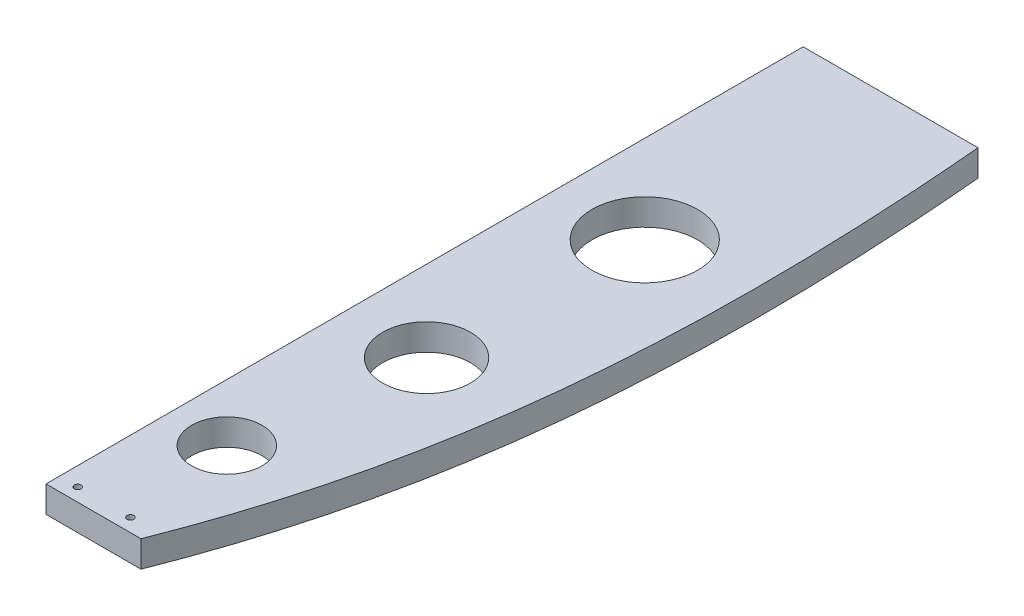
ISO-10303-21;
HEADER;
FILE_DESCRIPTION(('STEP AP214'),'2;1');
FILE_NAME('part.step','',(''),(''),'','','');
FILE_SCHEMA(('AUTOMOTIVE_DESIGN { 1 0 10303 214 1 1 1 1 }'));
ENDSEC;
DATA;
#1=APPLICATION_CONTEXT('core data for automotive mechanical design processes');
#2=APPLICATION_PROTOCOL_DEFINITION('international standard','automotive_design',2000,#1);
#3=PRODUCT_CONTEXT('',#1,'mechanical');
#4=PRODUCT('Part','Part','',(#3));
#5=PRODUCT_RELATED_PRODUCT_CATEGORY('part','',(#4));
#6=PRODUCT_DEFINITION_FORMATION('','',#4);
#7=PRODUCT_DEFINITION_CONTEXT('part definition',#1,'design');
#8=PRODUCT_DEFINITION('design','',#6,#7);
#9=PRODUCT_DEFINITION_SHAPE('','',#8);
#10=(LENGTH_UNIT() NAMED_UNIT(*) SI_UNIT(.MILLI.,.METRE.));
#11=(NAMED_UNIT(*) PLANE_ANGLE_UNIT() SI_UNIT($,.RADIAN.));
#12=(NAMED_UNIT(*) SI_UNIT($,.STERADIAN.) SOLID_ANGLE_UNIT());
#13=UNCERTAINTY_MEASURE_WITH_UNIT(LENGTH_MEASURE(1.E-05),#10,'distance_accuracy_value','');
#14=(GEOMETRIC_REPRESENTATION_CONTEXT(3) GLOBAL_UNCERTAINTY_ASSIGNED_CONTEXT((#13)) GLOBAL_UNIT_ASSIGNED_CONTEXT((#10,
#11,#12)) REPRESENTATION_CONTEXT('',''));
#15=CARTESIAN_POINT('',(0.,0.,0.));
#16=DIRECTION('',(0.,0.,1.));
#17=DIRECTION('',(1.,0.,0.));
#18=AXIS2_PLACEMENT_3D('',#15,#16,#17);
#19=CARTESIAN_POINT('',(392.720476188399,5372.1,2956.72721358891));
#20=DIRECTION('',(0.,1.,0.));
#21=DIRECTION('',(0.,0.,1.));
#22=AXIS2_PLACEMENT_3D('',#19,#20,#21);
#23=PLANE('',#22);
#24=CARTESIAN_POINT('',(376.528681754762,5372.1,3220.41942707641));
#25=DIRECTION('',(0.,1.,0.));
#26=DIRECTION('',(0.,0.,1.));
#27=AXIS2_PLACEMENT_3D('',#24,#25,#26);
#28=CIRCLE('',#27,2.45744999999997);
#29=CARTESIAN_POINT('',(376.528681754762,5372.1,3222.87687707641));
#30=VERTEX_POINT('',#29);
#31=EDGE_CURVE('E461',#30,#30,#28,.T.);
#32=ORIENTED_EDGE('',*,*,#31,.T.);
#33=EDGE_LOOP('',(#32));
#34=FACE_BOUND('',#33,.T.);
#35=CARTESIAN_POINT('',(338.428578956923,5372.1,3220.4194270765));
#36=DIRECTION('',(0.,1.,0.));
#37=DIRECTION('',(0.,0.,1.));
#38=AXIS2_PLACEMENT_3D('',#35,#36,#37);
#39=CIRCLE('',#38,2.45744999999997);
#40=CARTESIAN_POINT('',(338.428578956923,5372.1,3222.8768770765));
#41=VERTEX_POINT('',#40);
#42=EDGE_CURVE('E114',#41,#41,#39,.T.);
#43=ORIENTED_EDGE('',*,*,#42,.T.);
#44=EDGE_LOOP('',(#43));
#45=FACE_BOUND('',#44,.T.);
#46=CARTESIAN_POINT('',(388.619999999992,5372.1,2861.31));
#47=DIRECTION('',(0.,1.,0.));
#48=DIRECTION('',(-1.,0.,0.));
#49=AXIS2_PLACEMENT_3D('',#46,#47,#48);
#50=CIRCLE('',#49,38.0999999999997);
#51=CARTESIAN_POINT('',(350.519999999992,5372.1,2861.31));
#52=VERTEX_POINT('',#51);
#53=EDGE_CURVE('E156',#52,#52,#50,.T.);
#54=ORIENTED_EDGE('',*,*,#53,.T.);
#55=EDGE_LOOP('',(#54));
#56=FACE_BOUND('',#55,.T.);
#57=CARTESIAN_POINT('',(383.539999999992,5372.1,3013.71));
#58=DIRECTION('',(0.,1.,0.));
#59=DIRECTION('',(-1.,0.,0.));
#60=AXIS2_PLACEMENT_3D('',#57,#58,#59);
#61=CIRCLE('',#60,31.75);
#62=CARTESIAN_POINT('',(351.789999999992,5372.1,3013.71));
#63=VERTEX_POINT('',#62);
#64=EDGE_CURVE('E486',#63,#63,#61,.T.);
#65=ORIENTED_EDGE('',*,*,#64,.T.);
#66=EDGE_LOOP('',(#65));
#67=FACE_BOUND('',#66,.T.);
#68=CARTESIAN_POINT('',(366.394999999992,5372.1,3140.71));
#69=DIRECTION('',(0.,1.,0.));
#70=DIRECTION('',(-1.,0.,0.));
#71=AXIS2_PLACEMENT_3D('',#68,#69,#70);
#72=CIRCLE('',#71,25.4);
#73=CARTESIAN_POINT('',(340.994999999992,5372.1,3140.71));
#74=VERTEX_POINT('',#73);
#75=EDGE_CURVE('E170',#74,#74,#72,.T.);
#76=ORIENTED_EDGE('',*,*,#75,.T.);
#77=EDGE_LOOP('',(#76));
#78=FACE_BOUND('',#77,.T.);
#79=DIRECTION('',(0.,0.,1.));
#80=VECTOR('',#79,1.);
#81=CARTESIAN_POINT('',(325.12,5372.1,2683.51));
#82=LINE('',#81,#80);
#83=CARTESIAN_POINT('',(325.12,5372.1,2683.51));
#84=VERTEX_POINT('',#83);
#85=CARTESIAN_POINT('',(325.12,5372.1,3229.94442717783));
#86=VERTEX_POINT('',#85);
#87=EDGE_CURVE('E162',#84,#86,#82,.T.);
#88=ORIENTED_EDGE('',*,*,#87,.F.);
#89=DIRECTION('',(-1.,0.,0.));
#90=VECTOR('',#89,1.);
#91=CARTESIAN_POINT('',(451.328190233737,5372.1,2683.51));
#92=LINE('',#91,#90);
#93=CARTESIAN_POINT('',(451.328190233737,5372.1,2683.51));
#94=VERTEX_POINT('',#93);
#95=EDGE_CURVE('E163',#94,#84,#92,.T.);
#96=ORIENTED_EDGE('',*,*,#95,.F.);
#97=CARTESIAN_POINT('',(393.682548612297,5372.1,3229.94442717783));
#98=CARTESIAN_POINT('',(394.456887278261,5372.1,3227.97409267507));
#99=CARTESIAN_POINT('',(395.224418386659,5372.1,3226.00108202925));
#100=CARTESIAN_POINT('',(396.745699742087,5372.1,3222.04984801669));
#101=CARTESIAN_POINT('',(397.499450552644,5372.1,3220.07162486692));
#102=CARTESIAN_POINT('',(398.993053269483,5372.1,3216.10998577864));
#103=CARTESIAN_POINT('',(399.732905469336,5372.1,3214.12656995082));
#104=CARTESIAN_POINT('',(401.198834415247,5372.1,3210.1539474909));
#105=CARTESIAN_POINT('',(401.92490676605,5372.1,3208.16473923706));
#106=CARTESIAN_POINT('',(403.362939318137,5372.1,3204.18117724008));
#107=CARTESIAN_POINT('',(404.074899215258,5372.1,3202.18682338709));
#108=CARTESIAN_POINT('',(405.484616665228,5372.1,3198.19301213818));
#109=CARTESIAN_POINT('',(406.182373587812,5372.1,3196.19355452019));
#110=CARTESIAN_POINT('',(408.953173030683,5372.1,3188.16137490408));
#111=CARTESIAN_POINT('',(410.968400672618,5372.1,3182.10857083572));
#112=CARTESIAN_POINT('',(414.867042059988,5372.1,3169.9598314745));
#113=CARTESIAN_POINT('',(416.750437957193,5372.1,3163.86389046404));
#114=CARTESIAN_POINT('',(420.384172507284,5372.1,3151.63202096788));
#115=CARTESIAN_POINT('',(422.13450234528,5372.1,3145.49608986225));
#116=CARTESIAN_POINT('',(425.501734798348,5372.1,3133.18776982584));
#117=CARTESIAN_POINT('',(427.118638031934,5372.1,3127.01538106421));
#118=CARTESIAN_POINT('',(430.220289757622,5372.1,3114.6349025104));
#119=CARTESIAN_POINT('',(431.704985678233,5372.1,3108.42679955208));
#120=CARTESIAN_POINT('',(434.542919092933,5372.1,3095.98083496866));
#121=CARTESIAN_POINT('',(435.896160515653,5372.1,3089.74297423873));
#122=CARTESIAN_POINT('',(438.473419996919,5372.1,3077.24069251174));
#123=CARTESIAN_POINT('',(439.697439319748,5372.1,3070.97627177516));
#124=CARTESIAN_POINT('',(442.019093536706,5372.1,3058.4242371645));
#125=CARTESIAN_POINT('',(443.116730957581,5372.1,3052.1366237567));
#126=CARTESIAN_POINT('',(445.53190242202,5372.1,3037.45725662658));
#127=CARTESIAN_POINT('',(446.8020226021,5372.1,3029.05767164538));
#128=CARTESIAN_POINT('',(449.133660073008,5372.1,3012.22966620934));
#129=CARTESIAN_POINT('',(450.195175381903,5372.1,3003.80124548132));
#130=CARTESIAN_POINT('',(452.119865470589,5372.1,2986.92177852863));
#131=CARTESIAN_POINT('',(452.983038440592,5372.1,2978.47073209822));
#132=CARTESIAN_POINT('',(454.52182313745,5372.1,2961.55244648694));
#133=CARTESIAN_POINT('',(455.197451604686,5372.1,2953.08520881928));
#134=CARTESIAN_POINT('',(456.372394967282,5372.1,2936.13867906095));
#135=CARTESIAN_POINT('',(456.871712957139,5372.1,2927.65938718446));
#136=CARTESIAN_POINT('',(457.49682462189,5372.1,2914.93467998271));
#137=CARTESIAN_POINT('',(457.68454951338,5372.1,2910.69219806393));
#138=CARTESIAN_POINT('',(458.020084952675,5372.1,2902.20564766661));
#139=CARTESIAN_POINT('',(458.16789557835,5372.1,2897.96157919117));
#140=CARTESIAN_POINT('',(458.39261386685,5372.1,2890.54167375211));
#141=CARTESIAN_POINT('',(458.478002740263,5372.1,2887.36608909858));
#142=CARTESIAN_POINT('',(458.62741559634,5372.1,2881.01442207913));
#143=CARTESIAN_POINT('',(458.69143962297,5372.1,2877.83833971425));
#144=CARTESIAN_POINT('',(458.798866254698,5372.1,2871.48592736605));
#145=CARTESIAN_POINT('',(458.842269506911,5372.1,2868.30959739364));
#146=CARTESIAN_POINT('',(458.909067808656,5372.1,2861.95672988344));
#147=CARTESIAN_POINT('',(458.932462844902,5372.1,2858.78019234551));
#148=CARTESIAN_POINT('',(458.973523832038,5372.1,2849.25164706475));
#149=CARTESIAN_POINT('',(458.962085713271,5372.1,2842.8994936941));
#150=CARTESIAN_POINT('',(458.865746069073,5372.1,2830.19568475043));
#151=CARTESIAN_POINT('',(458.780843498029,5372.1,2823.84402918579));
#152=CARTESIAN_POINT('',(458.555440423178,5372.1,2811.90254793619));
#153=CARTESIAN_POINT('',(458.422814807489,5372.1,2806.31257153562));
#154=CARTESIAN_POINT('',(458.105397741391,5372.1,2795.13403521731));
#155=CARTESIAN_POINT('',(457.920605650512,5372.1,2789.54547531779));
#156=CARTESIAN_POINT('',(457.50058654664,5372.1,2778.37016686811));
#157=CARTESIAN_POINT('',(457.265358727712,5372.1,2772.78341834832));
#158=CARTESIAN_POINT('',(456.745902375998,5372.1,2761.61213595354));
#159=CARTESIAN_POINT('',(456.461673251714,5372.1,2756.0276021061));
#160=CARTESIAN_POINT('',(455.845303056687,5372.1,2744.86008184125));
#161=CARTESIAN_POINT('',(455.513152591962,5372.1,2739.27709594277));
#162=CARTESIAN_POINT('',(454.801842865255,5372.1,2728.11418570015));
#163=CARTESIAN_POINT('',(454.422684125743,5372.1,2722.53426132267));
#164=CARTESIAN_POINT('',(453.617925963619,5372.1,2711.3779283249));
#165=CARTESIAN_POINT('',(453.192327964684,5372.1,2705.80151960208));
#166=CARTESIAN_POINT('',(452.519277338355,5372.1,2697.4398551389));
#167=CARTESIAN_POINT('',(452.289157668395,5372.1,2694.65319423764));
#168=CARTESIAN_POINT('',(451.817351920112,5372.1,2689.08085188907));
#169=CARTESIAN_POINT('',(451.575665842301,5372.1,2686.29517044172));
#170=CARTESIAN_POINT('',(451.328190233737,5372.1,2683.51));
#171=B_SPLINE_CURVE_WITH_KNOTS('',3,(#97,#98,#99,#100,#101,#102,#103,#104,#105,#106,#107,#108,
#109,#110,#111,#112,#113,#114,#115,#116,#117,#118,#119,#120,#121,#122,#123,#124,#125,#126,#127,
#128,#129,#130,#131,#132,#133,#134,#135,#136,#137,#138,#139,#140,#141,#142,#143,#144,#145,#146,
#147,#148,#149,#150,#151,#152,#153,#154,#155,#156,#157,#158,#159,#160,#161,#162,#163,#164,#165,
#166,#167,#168,#169,#170),.UNSPECIFIED.,.F.,.F.,(4,2,2,2,2,2,2,2,2,2,2,2,2,2,2,2,2,2,2,2,2,2,2,
2,2,2,2,2,2,2,2,2,2,2,2,2,4),(0.,6.35108009996956,12.7018998972628,19.0525853991757,
25.4052635958806,31.7580785621476,38.1111748266912,57.2478936892729,76.3871984126718,
95.527769906086,114.66825266624,133.816312856681,152.96380061474,172.111101020311,
191.258018548431,216.74035075125,242.222925047358,267.705731851513,293.186263306885,
318.666347521117,331.40609726997,344.145822164442,353.675953643452,363.206065510394,
372.735878286335,382.265697390113,401.3216964695,420.377966775742,437.152367296034,
453.926973771489,470.701848315528,487.476925363987,504.255295296115,521.033478762763,
537.811148008957,546.199566113043,554.587983845863),.UNSPECIFIED.);
#172=CARTESIAN_POINT('',(393.682548612297,5372.1,3229.94442717783));
#173=VERTEX_POINT('',#172);
#174=EDGE_CURVE('E81',#173,#94,#171,.T.);
#175=ORIENTED_EDGE('',*,*,#174,.F.);
#176=DIRECTION('',(1.,0.,0.));
#177=VECTOR('',#176,1.);
#178=CARTESIAN_POINT('',(325.12,5372.1,3229.94442717783));
#179=LINE('',#178,#177);
#180=EDGE_CURVE('E188',#86,#173,#179,.T.);
#181=ORIENTED_EDGE('',*,*,#180,.F.);
#182=EDGE_LOOP('',(#88,#96,#175,#181));
#183=FACE_BOUND('',#182,.T.);
#184=ADVANCED_FACE('F35',(#34,#45,#56,#67,#78,#183),#23,.F.);
#185=CARTESIAN_POINT('',(325.12,5372.1,3229.94442717783));
#186=DIRECTION('',(0.,0.,1.));
#187=DIRECTION('',(1.,0.,0.));
#188=AXIS2_PLACEMENT_3D('',#185,#186,#187);
#189=PLANE('',#188);
#190=DIRECTION('',(1.,0.,0.));
#191=VECTOR('',#190,1.);
#192=CARTESIAN_POINT('',(392.720476188399,5391.15,3229.94442717783));
#193=LINE('',#192,#191);
#194=CARTESIAN_POINT('',(325.12,5391.15,3229.94442717783));
#195=VERTEX_POINT('',#194);
#196=CARTESIAN_POINT('',(393.682548612297,5391.15,3229.94442717783));
#197=VERTEX_POINT('',#196);
#198=EDGE_CURVE('E153',#195,#197,#193,.T.);
#199=ORIENTED_EDGE('',*,*,#198,.F.);
#200=DIRECTION('',(0.,1.,0.));
#201=VECTOR('',#200,1.);
#202=CARTESIAN_POINT('',(325.12,5372.1,3229.94442717783));
#203=LINE('',#202,#201);
#204=EDGE_CURVE('E171',#86,#195,#203,.T.);
#205=ORIENTED_EDGE('',*,*,#204,.F.);
#206=ORIENTED_EDGE('',*,*,#180,.T.);
#207=DIRECTION('',(0.,-1.,0.));
#208=VECTOR('',#207,1.);
#209=CARTESIAN_POINT('',(393.682548612297,5381.625,3229.94442717783));
#210=LINE('',#209,#208);
#211=EDGE_CURVE('E174',#197,#173,#210,.T.);
#212=ORIENTED_EDGE('',*,*,#211,.F.);
#213=EDGE_LOOP('',(#199,#205,#206,#212));
#214=FACE_BOUND('',#213,.T.);
#215=ADVANCED_FACE('F232',(#214),#189,.T.);
#216=CARTESIAN_POINT('',(393.682548612297,5372.1,3229.94442717783));
#217=CARTESIAN_POINT('',(393.682548612297,5391.15,3229.94442717783));
#218=CARTESIAN_POINT('',(433.140972393041,5372.1,3129.54068836821));
#219=CARTESIAN_POINT('',(433.140972393041,5391.15,3129.54068836821));
#220=CARTESIAN_POINT('',(454.834742459105,5372.1,3022.43692802554));
#221=CARTESIAN_POINT('',(454.834742459105,5391.15,3022.43692802554));
#222=CARTESIAN_POINT('',(460.312828518181,5372.1,2819.19788970161));
#223=CARTESIAN_POINT('',(460.312828518181,5391.15,2819.19788970161));
#224=CARTESIAN_POINT('',(457.003208667205,5372.1,2747.37762040659));
#225=CARTESIAN_POINT('',(457.003208667205,5391.15,2747.37762040659));
#226=CARTESIAN_POINT('',(451.328190233737,5372.1,2683.51));
#227=CARTESIAN_POINT('',(451.328190233737,5391.15,2683.51));
#228=B_SPLINE_SURFACE_WITH_KNOTS('',3,1,((#216,#217),(#218,#219),(#220,#221),(#222,#223),(#224,
#225),(#226,#227)),.UNSPECIFIED.,.F.,.F.,.F.,(4,2,4),(2,2),(-54.2493510406912,-24.5787816023228,
-9.05068072297407),(0.,1.90499999999997),.UNSPECIFIED.);
#229=CARTESIAN_POINT('',(393.682548612297,5391.15,3229.94442717783));
#230=CARTESIAN_POINT('',(394.45688727826,5391.15,3227.97409267507));
#231=CARTESIAN_POINT('',(395.224418386658,5391.15,3226.00108202925));
#232=CARTESIAN_POINT('',(396.745699742086,5391.15,3222.04984801669));
#233=CARTESIAN_POINT('',(397.499450552644,5391.15,3220.07162486692));
#234=CARTESIAN_POINT('',(398.993053269483,5391.15,3216.10998577864));
#235=CARTESIAN_POINT('',(399.732905469336,5391.15,3214.12656995082));
#236=CARTESIAN_POINT('',(401.198834415247,5391.15,3210.1539474909));
#237=CARTESIAN_POINT('',(401.924906766051,5391.15,3208.16473923706));
#238=CARTESIAN_POINT('',(403.362939318138,5391.15,3204.18117724008));
#239=CARTESIAN_POINT('',(404.074899215258,5391.15,3202.18682338709));
#240=CARTESIAN_POINT('',(405.484616665227,5391.15,3198.19301213818));
#241=CARTESIAN_POINT('',(406.182373587811,5391.15,3196.19355452019));
#242=CARTESIAN_POINT('',(408.953173030683,5391.15,3188.16137490408));
#243=CARTESIAN_POINT('',(410.968400672618,5391.15,3182.10857083572));
#244=CARTESIAN_POINT('',(414.867042059988,5391.15,3169.9598314745));
#245=CARTESIAN_POINT('',(416.750437957193,5391.15,3163.86389046404));
#246=CARTESIAN_POINT('',(420.384172507284,5391.15,3151.63202096788));
#247=CARTESIAN_POINT('',(422.13450234528,5391.15,3145.49608986225));
#248=CARTESIAN_POINT('',(425.501734798348,5391.15,3133.18776982584));
#249=CARTESIAN_POINT('',(427.118638031934,5391.15,3127.01538106421));
#250=CARTESIAN_POINT('',(430.220289757622,5391.15,3114.6349025104));
#251=CARTESIAN_POINT('',(431.704985678233,5391.15,3108.42679955208));
#252=CARTESIAN_POINT('',(434.542919092933,5391.15,3095.98083496866));
#253=CARTESIAN_POINT('',(435.896160515653,5391.15,3089.74297423873));
#254=CARTESIAN_POINT('',(438.473419996919,5391.15,3077.24069251174));
#255=CARTESIAN_POINT('',(439.697439319748,5391.15,3070.97627177516));
#256=CARTESIAN_POINT('',(442.019093536706,5391.15,3058.4242371645));
#257=CARTESIAN_POINT('',(443.116730957581,5391.15,3052.1366237567));
#258=CARTESIAN_POINT('',(445.53190242202,5391.15,3037.45725662658));
#259=CARTESIAN_POINT('',(446.8020226021,5391.15,3029.05767164538));
#260=CARTESIAN_POINT('',(449.133660073008,5391.15,3012.22966620934));
#261=CARTESIAN_POINT('',(450.195175381904,5391.15,3003.80124548132));
#262=CARTESIAN_POINT('',(452.119865470589,5391.15,2986.92177852863));
#263=CARTESIAN_POINT('',(452.983038440592,5391.15,2978.47073209822));
#264=CARTESIAN_POINT('',(454.52182313745,5391.15,2961.55244648694));
#265=CARTESIAN_POINT('',(455.197451604686,5391.15,2953.08520881928));
#266=CARTESIAN_POINT('',(456.372394967282,5391.15,2936.13867906095));
#267=CARTESIAN_POINT('',(456.871712957139,5391.15,2927.65938718446));
#268=CARTESIAN_POINT('',(457.49682462189,5391.15,2914.93467998271));
#269=CARTESIAN_POINT('',(457.68454951338,5391.15,2910.69219806393));
#270=CARTESIAN_POINT('',(458.020084952675,5391.15,2902.20564766661));
#271=CARTESIAN_POINT('',(458.16789557835,5391.15,2897.96157919117));
#272=CARTESIAN_POINT('',(458.39261386685,5391.15,2890.54167375211));
#273=CARTESIAN_POINT('',(458.478002740263,5391.15,2887.36608909858));
#274=CARTESIAN_POINT('',(458.62741559634,5391.15,2881.01442207913));
#275=CARTESIAN_POINT('',(458.69143962297,5391.15,2877.83833971425));
#276=CARTESIAN_POINT('',(458.798866254698,5391.15,2871.48592736605));
#277=CARTESIAN_POINT('',(458.842269506911,5391.15,2868.30959739364));
#278=CARTESIAN_POINT('',(458.909067808656,5391.15,2861.95672988344));
#279=CARTESIAN_POINT('',(458.932462844902,5391.15,2858.78019234551));
#280=CARTESIAN_POINT('',(458.973523832038,5391.15,2849.25164706475));
#281=CARTESIAN_POINT('',(458.962085713271,5391.15,2842.8994936941));
#282=CARTESIAN_POINT('',(458.865746069073,5391.15,2830.19568475043));
#283=CARTESIAN_POINT('',(458.780843498029,5391.15,2823.84402918579));
#284=CARTESIAN_POINT('',(458.555440423178,5391.15,2811.90254793619));
#285=CARTESIAN_POINT('',(458.422814807489,5391.15,2806.31257153562));
#286=CARTESIAN_POINT('',(458.105397741391,5391.15,2795.13403521731));
#287=CARTESIAN_POINT('',(457.920605650512,5391.15,2789.54547531779));
#288=CARTESIAN_POINT('',(457.50058654664,5391.15,2778.37016686811));
#289=CARTESIAN_POINT('',(457.265358727712,5391.15,2772.78341834832));
#290=CARTESIAN_POINT('',(456.745902375998,5391.15,2761.61213595354));
#291=CARTESIAN_POINT('',(456.461673251714,5391.15,2756.0276021061));
#292=CARTESIAN_POINT('',(455.845303056687,5391.15,2744.86008184125));
#293=CARTESIAN_POINT('',(455.513152591963,5391.15,2739.27709594277));
#294=CARTESIAN_POINT('',(454.801842865255,5391.15,2728.11418570015));
#295=CARTESIAN_POINT('',(454.422684125743,5391.15,2722.53426132267));
#296=CARTESIAN_POINT('',(453.617925963619,5391.15,2711.3779283249));
#297=CARTESIAN_POINT('',(453.192327964684,5391.15,2705.80151960208));
#298=CARTESIAN_POINT('',(452.519277338355,5391.15,2697.4398551389));
#299=CARTESIAN_POINT('',(452.289157668395,5391.15,2694.65319423764));
#300=CARTESIAN_POINT('',(451.817351920112,5391.15,2689.08085188907));
#301=CARTESIAN_POINT('',(451.575665842301,5391.15,2686.29517044172));
#302=CARTESIAN_POINT('',(451.328190233737,5391.15,2683.51));
#303=B_SPLINE_CURVE_WITH_KNOTS('',3,(#229,#230,#231,#232,#233,#234,#235,#236,#237,#238,#239,
#240,#241,#242,#243,#244,#245,#246,#247,#248,#249,#250,#251,#252,#253,#254,#255,#256,#257,#258,
#259,#260,#261,#262,#263,#264,#265,#266,#267,#268,#269,#270,#271,#272,#273,#274,#275,#276,#277,
#278,#279,#280,#281,#282,#283,#284,#285,#286,#287,#288,#289,#290,#291,#292,#293,#294,#295,#296,
#297,#298,#299,#300,#301,#302),.UNSPECIFIED.,.F.,.F.,(4,2,2,2,2,2,2,2,2,2,2,2,2,2,2,2,2,2,2,2,2,
2,2,2,2,2,2,2,2,2,2,2,2,2,2,2,4),(0.,6.35108009996983,12.7018998972628,19.0525853991757,
25.4052635958808,31.7580785621479,38.1111748266912,57.2478936892729,76.3871984126718,
95.527769906086,114.66825266624,133.816312856681,152.96380061474,172.111101020311,
191.258018548431,216.74035075125,242.222925047358,267.705731851513,293.186263306885,
318.666347521117,331.40609726997,344.145822164442,353.675953643452,363.206065510394,
372.735878286335,382.265697390113,401.3216964695,420.377966775742,437.152367296034,
453.926973771489,470.701848315528,487.476925363987,504.255295296115,521.033478762763,
537.811148008957,546.199566113043,554.587983845863),.UNSPECIFIED.);
#304=CARTESIAN_POINT('',(451.328190233737,5391.15,2683.51));
#305=VERTEX_POINT('',#304);
#306=EDGE_CURVE('E150',#197,#305,#303,.T.);
#307=DIRECTION('',(0.,1.,0.));
#308=VECTOR('',#307,1.);
#309=CARTESIAN_POINT('',(451.328190233737,5372.1,2683.51));
#310=LINE('',#309,#308);
#311=EDGE_CURVE('E159',#305,#94,#310,.F.);
#312=ORIENTED_EDGE('',*,*,#306,.F.);
#313=ORIENTED_EDGE('',*,*,#211,.T.);
#314=ORIENTED_EDGE('',*,*,#174,.T.);
#315=ORIENTED_EDGE('',*,*,#311,.F.);
#316=EDGE_LOOP('',(#312,#313,#314,#315));
#317=FACE_BOUND('',#316,.T.);
#318=ADVANCED_FACE('F37',(#317),#228,.T.);
#319=CARTESIAN_POINT('',(451.328190233737,5372.1,2683.51));
#320=DIRECTION('',(0.,0.,-1.));
#321=DIRECTION('',(-1.,0.,0.));
#322=AXIS2_PLACEMENT_3D('',#319,#320,#321);
#323=PLANE('',#322);
#324=CARTESIAN_POINT('',(419.531342480865,5381.625,2683.51));
#325=DIRECTION('',(0.,0.,-1.));
#326=DIRECTION('',(-1.,0.,0.));
#327=AXIS2_PLACEMENT_3D('',#324,#325,#326);
#328=CIRCLE('',#327,0.991870000000006);
#329=CARTESIAN_POINT('',(418.539472480865,5381.625,2683.51));
#330=VERTEX_POINT('',#329);
#331=EDGE_CURVE('E141',#330,#330,#328,.T.);
#332=ORIENTED_EDGE('',*,*,#331,.F.);
#333=EDGE_LOOP('',(#332));
#334=FACE_BOUND('',#333,.T.);
#335=CARTESIAN_POINT('',(356.590447493622,5381.625,2683.51));
#336=DIRECTION('',(0.,0.,-1.));
#337=DIRECTION('',(-1.,0.,0.));
#338=AXIS2_PLACEMENT_3D('',#335,#336,#337);
#339=CIRCLE('',#338,0.991870000000006);
#340=CARTESIAN_POINT('',(355.598577493622,5381.625,2683.51));
#341=VERTEX_POINT('',#340);
#342=EDGE_CURVE('E145',#341,#341,#339,.T.);
#343=ORIENTED_EDGE('',*,*,#342,.F.);
#344=EDGE_LOOP('',(#343));
#345=FACE_BOUND('',#344,.T.);
#346=DIRECTION('',(1.,0.,0.));
#347=VECTOR('',#346,1.);
#348=CARTESIAN_POINT('',(392.720476188399,5391.15,2683.51));
#349=LINE('',#348,#347);
#350=CARTESIAN_POINT('',(325.12,5391.15,2683.51));
#351=VERTEX_POINT('',#350);
#352=EDGE_CURVE('E146',#305,#351,#349,.F.);
#353=ORIENTED_EDGE('',*,*,#352,.F.);
#354=ORIENTED_EDGE('',*,*,#311,.T.);
#355=ORIENTED_EDGE('',*,*,#95,.T.);
#356=DIRECTION('',(0.,1.,0.));
#357=VECTOR('',#356,1.);
#358=CARTESIAN_POINT('',(325.12,5372.1,2683.51));
#359=LINE('',#358,#357);
#360=EDGE_CURVE('E57',#351,#84,#359,.F.);
#361=ORIENTED_EDGE('',*,*,#360,.F.);
#362=EDGE_LOOP('',(#353,#354,#355,#361));
#363=FACE_BOUND('',#362,.T.);
#364=ADVANCED_FACE('F227',(#334,#345,#363),#323,.T.);
#365=CARTESIAN_POINT('',(325.12,5372.1,2683.51));
#366=DIRECTION('',(-1.,0.,0.));
#367=DIRECTION('',(0.,0.,1.));
#368=AXIS2_PLACEMENT_3D('',#365,#366,#367);
#369=PLANE('',#368);
#370=CARTESIAN_POINT('',(325.12,5381.625,2785.11));
#371=DIRECTION('',(-1.,0.,0.));
#372=DIRECTION('',(0.,0.,1.));
#373=AXIS2_PLACEMENT_3D('',#370,#371,#372);
#374=CIRCLE('',#373,0.991870000000006);
#375=CARTESIAN_POINT('',(325.12,5381.625,2786.10187));
#376=VERTEX_POINT('',#375);
#377=EDGE_CURVE('E42',#376,#376,#374,.T.);
#378=ORIENTED_EDGE('',*,*,#377,.F.);
#379=EDGE_LOOP('',(#378));
#380=FACE_BOUND('',#379,.T.);
#381=CARTESIAN_POINT('',(325.12,5381.625,2886.71));
#382=DIRECTION('',(-1.,0.,0.));
#383=DIRECTION('',(0.,0.,1.));
#384=AXIS2_PLACEMENT_3D('',#381,#382,#383);
#385=CIRCLE('',#384,0.991870000000006);
#386=CARTESIAN_POINT('',(325.12,5381.625,2887.70187));
#387=VERTEX_POINT('',#386);
#388=EDGE_CURVE('E125',#387,#387,#385,.T.);
#389=ORIENTED_EDGE('',*,*,#388,.F.);
#390=EDGE_LOOP('',(#389));
#391=FACE_BOUND('',#390,.T.);
#392=CARTESIAN_POINT('',(325.12,5381.625,2988.31));
#393=DIRECTION('',(-1.,0.,0.));
#394=DIRECTION('',(0.,0.,1.));
#395=AXIS2_PLACEMENT_3D('',#392,#393,#394);
#396=CIRCLE('',#395,0.991870000000006);
#397=CARTESIAN_POINT('',(325.12,5381.625,2989.30187));
#398=VERTEX_POINT('',#397);
#399=EDGE_CURVE('E129',#398,#398,#396,.T.);
#400=ORIENTED_EDGE('',*,*,#399,.F.);
#401=EDGE_LOOP('',(#400));
#402=FACE_BOUND('',#401,.T.);
#403=CARTESIAN_POINT('',(325.12,5381.625,3089.91));
#404=DIRECTION('',(-1.,0.,0.));
#405=DIRECTION('',(0.,0.,1.));
#406=AXIS2_PLACEMENT_3D('',#403,#404,#405);
#407=CIRCLE('',#406,0.991870000000006);
#408=CARTESIAN_POINT('',(325.12,5381.625,3090.90187));
#409=VERTEX_POINT('',#408);
#410=EDGE_CURVE('E133',#409,#409,#407,.T.);
#411=ORIENTED_EDGE('',*,*,#410,.F.);
#412=EDGE_LOOP('',(#411));
#413=FACE_BOUND('',#412,.T.);
#414=CARTESIAN_POINT('',(325.12,5381.625,3191.51));
#415=DIRECTION('',(-1.,0.,0.));
#416=DIRECTION('',(0.,0.,1.));
#417=AXIS2_PLACEMENT_3D('',#414,#415,#416);
#418=CIRCLE('',#417,0.991870000000006);
#419=CARTESIAN_POINT('',(325.12,5381.625,3192.50187));
#420=VERTEX_POINT('',#419);
#421=EDGE_CURVE('E137',#420,#420,#418,.T.);
#422=ORIENTED_EDGE('',*,*,#421,.F.);
#423=EDGE_LOOP('',(#422));
#424=FACE_BOUND('',#423,.T.);
#425=DIRECTION('',(0.,0.,1.));
#426=VECTOR('',#425,1.);
#427=CARTESIAN_POINT('',(325.12,5391.15,2956.72721358891));
#428=LINE('',#427,#426);
#429=EDGE_CURVE('E149',#351,#195,#428,.T.);
#430=ORIENTED_EDGE('',*,*,#429,.F.);
#431=ORIENTED_EDGE('',*,*,#360,.T.);
#432=ORIENTED_EDGE('',*,*,#87,.T.);
#433=ORIENTED_EDGE('',*,*,#204,.T.);
#434=EDGE_LOOP('',(#430,#431,#432,#433));
#435=FACE_BOUND('',#434,.T.);
#436=ADVANCED_FACE('F223',(#380,#391,#402,#413,#424,#435),#369,.T.);
#437=CARTESIAN_POINT('',(366.395,5194.3,3140.71));
#438=DIRECTION('',(0.,1.,0.));
#439=DIRECTION('',(-1.,0.,0.));
#440=AXIS2_PLACEMENT_3D('',#437,#438,#439);
#441=CYLINDRICAL_SURFACE('',#440,25.4);
#442=ORIENTED_EDGE('',*,*,#75,.F.);
#443=EDGE_LOOP('',(#442));
#444=FACE_BOUND('',#443,.T.);
#445=CARTESIAN_POINT('',(366.394999999991,5391.15,3140.71));
#446=DIRECTION('',(0.,1.,0.));
#447=DIRECTION('',(-1.,0.,0.));
#448=AXIS2_PLACEMENT_3D('',#445,#446,#447);
#449=CIRCLE('',#448,25.4);
#450=CARTESIAN_POINT('',(340.994999999991,5391.15,3140.71));
#451=VERTEX_POINT('',#450);
#452=EDGE_CURVE('E166',#451,#451,#449,.F.);
#453=ORIENTED_EDGE('',*,*,#452,.F.);
#454=EDGE_LOOP('',(#453));
#455=FACE_BOUND('',#454,.T.);
#456=ADVANCED_FACE('F219',(#444,#455),#441,.F.);
#457=CARTESIAN_POINT('',(383.54,5194.3,3013.71));
#458=DIRECTION('',(0.,1.,0.));
#459=DIRECTION('',(-1.,0.,0.));
#460=AXIS2_PLACEMENT_3D('',#457,#458,#459);
#461=CYLINDRICAL_SURFACE('',#460,31.75);
#462=ORIENTED_EDGE('',*,*,#64,.F.);
#463=EDGE_LOOP('',(#462));
#464=FACE_BOUND('',#463,.T.);
#465=CARTESIAN_POINT('',(383.539999999991,5391.15,3013.71));
#466=DIRECTION('',(0.,1.,0.));
#467=DIRECTION('',(-1.,0.,0.));
#468=AXIS2_PLACEMENT_3D('',#465,#466,#467);
#469=CIRCLE('',#468,31.75);
#470=CARTESIAN_POINT('',(351.789999999991,5391.15,3013.71));
#471=VERTEX_POINT('',#470);
#472=EDGE_CURVE('E48',#471,#471,#469,.F.);
#473=ORIENTED_EDGE('',*,*,#472,.F.);
#474=EDGE_LOOP('',(#473));
#475=FACE_BOUND('',#474,.T.);
#476=ADVANCED_FACE('F215',(#464,#475),#461,.F.);
#477=CARTESIAN_POINT('',(388.62,5194.3,2861.31));
#478=DIRECTION('',(0.,1.,0.));
#479=DIRECTION('',(-1.,0.,0.));
#480=AXIS2_PLACEMENT_3D('',#477,#478,#479);
#481=CYLINDRICAL_SURFACE('',#480,38.0999999999997);
#482=ORIENTED_EDGE('',*,*,#53,.F.);
#483=EDGE_LOOP('',(#482));
#484=FACE_BOUND('',#483,.T.);
#485=CARTESIAN_POINT('',(388.619999999991,5391.15,2861.31));
#486=DIRECTION('',(0.,1.,0.));
#487=DIRECTION('',(-1.,0.,0.));
#488=AXIS2_PLACEMENT_3D('',#485,#486,#487);
#489=CIRCLE('',#488,38.0999999999997);
#490=CARTESIAN_POINT('',(350.519999999992,5391.15,2861.31));
#491=VERTEX_POINT('',#490);
#492=EDGE_CURVE('E11',#491,#491,#489,.F.);
#493=ORIENTED_EDGE('',*,*,#492,.F.);
#494=EDGE_LOOP('',(#493));
#495=FACE_BOUND('',#494,.T.);
#496=ADVANCED_FACE('F210',(#484,#495),#481,.F.);
#497=CARTESIAN_POINT('',(392.720476188399,5391.15,2956.72721358891));
#498=DIRECTION('',(0.,1.,0.));
#499=DIRECTION('',(0.,0.,1.));
#500=AXIS2_PLACEMENT_3D('',#497,#498,#499);
#501=PLANE('',#500);
#502=CARTESIAN_POINT('',(376.528681754762,5391.15,3220.41942707641));
#503=DIRECTION('',(0.,1.,0.));
#504=DIRECTION('',(0.,0.,1.));
#505=AXIS2_PLACEMENT_3D('',#502,#503,#504);
#506=CIRCLE('',#505,2.45744999999997);
#507=CARTESIAN_POINT('',(376.528681754762,5391.15,3222.87687707641));
#508=VERTEX_POINT('',#507);
#509=EDGE_CURVE('E458',#508,#508,#506,.T.);
#510=ORIENTED_EDGE('',*,*,#509,.F.);
#511=EDGE_LOOP('',(#510));
#512=FACE_BOUND('',#511,.T.);
#513=CARTESIAN_POINT('',(338.428578956923,5391.15,3220.4194270765));
#514=DIRECTION('',(0.,1.,0.));
#515=DIRECTION('',(0.,0.,1.));
#516=AXIS2_PLACEMENT_3D('',#513,#514,#515);
#517=CIRCLE('',#516,2.45744999999997);
#518=CARTESIAN_POINT('',(338.428578956923,5391.15,3222.8768770765));
#519=VERTEX_POINT('',#518);
#520=EDGE_CURVE('E119',#519,#519,#517,.T.);
#521=ORIENTED_EDGE('',*,*,#520,.F.);
#522=EDGE_LOOP('',(#521));
#523=FACE_BOUND('',#522,.T.);
#524=ORIENTED_EDGE('',*,*,#492,.T.);
#525=EDGE_LOOP('',(#524));
#526=FACE_BOUND('',#525,.T.);
#527=ORIENTED_EDGE('',*,*,#472,.T.);
#528=EDGE_LOOP('',(#527));
#529=FACE_BOUND('',#528,.T.);
#530=ORIENTED_EDGE('',*,*,#452,.T.);
#531=EDGE_LOOP('',(#530));
#532=FACE_BOUND('',#531,.T.);
#533=ORIENTED_EDGE('',*,*,#352,.T.);
#534=ORIENTED_EDGE('',*,*,#429,.T.);
#535=ORIENTED_EDGE('',*,*,#198,.T.);
#536=ORIENTED_EDGE('',*,*,#306,.T.);
#537=EDGE_LOOP('',(#533,#534,#535,#536));
#538=FACE_BOUND('',#537,.T.);
#539=ADVANCED_FACE('F204',(#512,#523,#526,#529,#532,#538),#501,.T.);
#540=CARTESIAN_POINT('',(356.590447493622,5381.625,2702.56));
#541=DIRECTION('',(0.,0.,-1.));
#542=DIRECTION('',(-1.,0.,0.));
#543=AXIS2_PLACEMENT_3D('',#540,#541,#542);
#544=CONICAL_SURFACE('',#543,0.991870000000006,1.02974425867677);
#545=CARTESIAN_POINT('',(356.590447493622,5381.625,2703.1559756222));
#546=VERTEX_POINT('',#545);
#547=VERTEX_LOOP('',#546);
#548=FACE_BOUND('',#547,.T.);
#549=CARTESIAN_POINT('',(356.590447493622,5381.625,2702.56));
#550=DIRECTION('',(0.,0.,-1.));
#551=DIRECTION('',(-1.,0.,0.));
#552=AXIS2_PLACEMENT_3D('',#549,#550,#551);
#553=CIRCLE('',#552,0.991870000000006);
#554=CARTESIAN_POINT('',(355.598577493622,5381.625,2702.56));
#555=VERTEX_POINT('',#554);
#556=EDGE_CURVE('E142',#555,#555,#553,.T.);
#557=ORIENTED_EDGE('',*,*,#556,.T.);
#558=EDGE_LOOP('',(#557));
#559=FACE_BOUND('',#558,.T.);
#560=ADVANCED_FACE('F209',(#548,#559),#544,.F.);
#561=CARTESIAN_POINT('',(356.590447493622,5381.625,2664.46));
#562=DIRECTION('',(0.,0.,-1.));
#563=DIRECTION('',(-1.,0.,0.));
#564=AXIS2_PLACEMENT_3D('',#561,#562,#563);
#565=CYLINDRICAL_SURFACE('',#564,0.991870000000006);
#566=ORIENTED_EDGE('',*,*,#342,.T.);
#567=EDGE_LOOP('',(#566));
#568=FACE_BOUND('',#567,.T.);
#569=ORIENTED_EDGE('',*,*,#556,.F.);
#570=EDGE_LOOP('',(#569));
#571=FACE_BOUND('',#570,.T.);
#572=ADVANCED_FACE('F315',(#568,#571),#565,.F.);
#573=CARTESIAN_POINT('',(419.531342480865,5381.625,2702.56));
#574=DIRECTION('',(0.,0.,-1.));
#575=DIRECTION('',(-1.,0.,0.));
#576=AXIS2_PLACEMENT_3D('',#573,#574,#575);
#577=CONICAL_SURFACE('',#576,0.991870000000006,1.02974425867677);
#578=CARTESIAN_POINT('',(419.531342480865,5381.625,2703.1559756222));
#579=VERTEX_POINT('',#578);
#580=VERTEX_LOOP('',#579);
#581=FACE_BOUND('',#580,.T.);
#582=CARTESIAN_POINT('',(419.531342480865,5381.625,2702.56));
#583=DIRECTION('',(0.,0.,-1.));
#584=DIRECTION('',(-1.,0.,0.));
#585=AXIS2_PLACEMENT_3D('',#582,#583,#584);
#586=CIRCLE('',#585,0.991870000000006);
#587=CARTESIAN_POINT('',(418.539472480865,5381.625,2702.56));
#588=VERTEX_POINT('',#587);
#589=EDGE_CURVE('E138',#588,#588,#586,.T.);
#590=ORIENTED_EDGE('',*,*,#589,.T.);
#591=EDGE_LOOP('',(#590));
#592=FACE_BOUND('',#591,.T.);
#593=ADVANCED_FACE('F320',(#581,#592),#577,.F.);
#594=CARTESIAN_POINT('',(419.531342480865,5381.625,2664.46));
#595=DIRECTION('',(0.,0.,-1.));
#596=DIRECTION('',(-1.,0.,0.));
#597=AXIS2_PLACEMENT_3D('',#594,#595,#596);
#598=CYLINDRICAL_SURFACE('',#597,0.991870000000006);
#599=ORIENTED_EDGE('',*,*,#331,.T.);
#600=EDGE_LOOP('',(#599));
#601=FACE_BOUND('',#600,.T.);
#602=ORIENTED_EDGE('',*,*,#589,.F.);
#603=EDGE_LOOP('',(#602));
#604=FACE_BOUND('',#603,.T.);
#605=ADVANCED_FACE('F327',(#601,#604),#598,.F.);
#606=CARTESIAN_POINT('',(344.17,5381.625,3191.51));
#607=DIRECTION('',(-1.,0.,0.));
#608=DIRECTION('',(0.,0.,1.));
#609=AXIS2_PLACEMENT_3D('',#606,#607,#608);
#610=CONICAL_SURFACE('',#609,0.991870000000006,1.02974425867665);
#611=CARTESIAN_POINT('',(344.765975622195,5381.625,3191.51));
#612=VERTEX_POINT('',#611);
#613=VERTEX_LOOP('',#612);
#614=FACE_BOUND('',#613,.T.);
#615=CARTESIAN_POINT('',(344.17,5381.625,3191.51));
#616=DIRECTION('',(-1.,0.,0.));
#617=DIRECTION('',(0.,0.,1.));
#618=AXIS2_PLACEMENT_3D('',#615,#616,#617);
#619=CIRCLE('',#618,0.991870000000006);
#620=CARTESIAN_POINT('',(344.17,5381.625,3192.50187));
#621=VERTEX_POINT('',#620);
#622=EDGE_CURVE('E134',#621,#621,#619,.T.);
#623=ORIENTED_EDGE('',*,*,#622,.T.);
#624=EDGE_LOOP('',(#623));
#625=FACE_BOUND('',#624,.T.);
#626=ADVANCED_FACE('F333',(#614,#625),#610,.F.);
#627=CARTESIAN_POINT('',(312.42,5381.625,3191.51));
#628=DIRECTION('',(-1.,0.,0.));
#629=DIRECTION('',(0.,0.,1.));
#630=AXIS2_PLACEMENT_3D('',#627,#628,#629);
#631=CYLINDRICAL_SURFACE('',#630,0.991870000000006);
#632=ORIENTED_EDGE('',*,*,#421,.T.);
#633=EDGE_LOOP('',(#632));
#634=FACE_BOUND('',#633,.T.);
#635=ORIENTED_EDGE('',*,*,#622,.F.);
#636=EDGE_LOOP('',(#635));
#637=FACE_BOUND('',#636,.T.);
#638=ADVANCED_FACE('F340',(#634,#637),#631,.F.);
#639=CARTESIAN_POINT('',(344.17,5381.625,3089.91));
#640=DIRECTION('',(-1.,0.,0.));
#641=DIRECTION('',(0.,0.,1.));
#642=AXIS2_PLACEMENT_3D('',#639,#640,#641);
#643=CONICAL_SURFACE('',#642,0.991870000000006,1.02974425867665);
#644=CARTESIAN_POINT('',(344.765975622195,5381.625,3089.91));
#645=VERTEX_POINT('',#644);
#646=VERTEX_LOOP('',#645);
#647=FACE_BOUND('',#646,.T.);
#648=CARTESIAN_POINT('',(344.17,5381.625,3089.91));
#649=DIRECTION('',(-1.,0.,0.));
#650=DIRECTION('',(0.,0.,1.));
#651=AXIS2_PLACEMENT_3D('',#648,#649,#650);
#652=CIRCLE('',#651,0.991870000000006);
#653=CARTESIAN_POINT('',(344.17,5381.625,3090.90187));
#654=VERTEX_POINT('',#653);
#655=EDGE_CURVE('E130',#654,#654,#652,.T.);
#656=ORIENTED_EDGE('',*,*,#655,.T.);
#657=EDGE_LOOP('',(#656));
#658=FACE_BOUND('',#657,.T.);
#659=ADVANCED_FACE('F348',(#647,#658),#643,.F.);
#660=CARTESIAN_POINT('',(312.42,5381.625,3089.91));
#661=DIRECTION('',(-1.,0.,0.));
#662=DIRECTION('',(0.,0.,1.));
#663=AXIS2_PLACEMENT_3D('',#660,#661,#662);
#664=CYLINDRICAL_SURFACE('',#663,0.991870000000006);
#665=ORIENTED_EDGE('',*,*,#410,.T.);
#666=EDGE_LOOP('',(#665));
#667=FACE_BOUND('',#666,.T.);
#668=ORIENTED_EDGE('',*,*,#655,.F.);
#669=EDGE_LOOP('',(#668));
#670=FACE_BOUND('',#669,.T.);
#671=ADVANCED_FACE('F356',(#667,#670),#664,.F.);
#672=CARTESIAN_POINT('',(344.17,5381.625,2988.31));
#673=DIRECTION('',(-1.,0.,0.));
#674=DIRECTION('',(0.,0.,1.));
#675=AXIS2_PLACEMENT_3D('',#672,#673,#674);
#676=CONICAL_SURFACE('',#675,0.991870000000006,1.02974425867665);
#677=CARTESIAN_POINT('',(344.765975622195,5381.625,2988.31));
#678=VERTEX_POINT('',#677);
#679=VERTEX_LOOP('',#678);
#680=FACE_BOUND('',#679,.T.);
#681=CARTESIAN_POINT('',(344.17,5381.625,2988.31));
#682=DIRECTION('',(-1.,0.,0.));
#683=DIRECTION('',(0.,0.,1.));
#684=AXIS2_PLACEMENT_3D('',#681,#682,#683);
#685=CIRCLE('',#684,0.991870000000006);
#686=CARTESIAN_POINT('',(344.17,5381.625,2989.30187));
#687=VERTEX_POINT('',#686);
#688=EDGE_CURVE('E126',#687,#687,#685,.T.);
#689=ORIENTED_EDGE('',*,*,#688,.T.);
#690=EDGE_LOOP('',(#689));
#691=FACE_BOUND('',#690,.T.);
#692=ADVANCED_FACE('F364',(#680,#691),#676,.F.);
#693=CARTESIAN_POINT('',(312.42,5381.625,2988.31));
#694=DIRECTION('',(-1.,0.,0.));
#695=DIRECTION('',(0.,0.,1.));
#696=AXIS2_PLACEMENT_3D('',#693,#694,#695);
#697=CYLINDRICAL_SURFACE('',#696,0.991870000000006);
#698=ORIENTED_EDGE('',*,*,#399,.T.);
#699=EDGE_LOOP('',(#698));
#700=FACE_BOUND('',#699,.T.);
#701=ORIENTED_EDGE('',*,*,#688,.F.);
#702=EDGE_LOOP('',(#701));
#703=FACE_BOUND('',#702,.T.);
#704=ADVANCED_FACE('F372',(#700,#703),#697,.F.);
#705=CARTESIAN_POINT('',(344.17,5381.625,2886.71));
#706=DIRECTION('',(-1.,0.,0.));
#707=DIRECTION('',(0.,0.,1.));
#708=AXIS2_PLACEMENT_3D('',#705,#706,#707);
#709=CONICAL_SURFACE('',#708,0.991870000000006,1.02974425867665);
#710=CARTESIAN_POINT('',(344.765975622195,5381.625,2886.71));
#711=VERTEX_POINT('',#710);
#712=VERTEX_LOOP('',#711);
#713=FACE_BOUND('',#712,.T.);
#714=CARTESIAN_POINT('',(344.17,5381.625,2886.71));
#715=DIRECTION('',(-1.,0.,0.));
#716=DIRECTION('',(0.,0.,1.));
#717=AXIS2_PLACEMENT_3D('',#714,#715,#716);
#718=CIRCLE('',#717,0.991870000000006);
#719=CARTESIAN_POINT('',(344.17,5381.625,2887.70187));
#720=VERTEX_POINT('',#719);
#721=EDGE_CURVE('E117',#720,#720,#718,.T.);
#722=ORIENTED_EDGE('',*,*,#721,.T.);
#723=EDGE_LOOP('',(#722));
#724=FACE_BOUND('',#723,.T.);
#725=ADVANCED_FACE('F380',(#713,#724),#709,.F.);
#726=CARTESIAN_POINT('',(312.42,5381.625,2886.71));
#727=DIRECTION('',(-1.,0.,0.));
#728=DIRECTION('',(0.,0.,1.));
#729=AXIS2_PLACEMENT_3D('',#726,#727,#728);
#730=CYLINDRICAL_SURFACE('',#729,0.991870000000006);
#731=ORIENTED_EDGE('',*,*,#388,.T.);
#732=EDGE_LOOP('',(#731));
#733=FACE_BOUND('',#732,.T.);
#734=ORIENTED_EDGE('',*,*,#721,.F.);
#735=EDGE_LOOP('',(#734));
#736=FACE_BOUND('',#735,.T.);
#737=ADVANCED_FACE('F108',(#733,#736),#730,.F.);
#738=CARTESIAN_POINT('',(344.17,5381.625,2785.11));
#739=DIRECTION('',(-1.,0.,0.));
#740=DIRECTION('',(0.,0.,1.));
#741=AXIS2_PLACEMENT_3D('',#738,#739,#740);
#742=CONICAL_SURFACE('',#741,0.991870000000006,1.02974425867665);
#743=CARTESIAN_POINT('',(344.765975622195,5381.625,2785.11));
#744=VERTEX_POINT('',#743);
#745=VERTEX_LOOP('',#744);
#746=FACE_BOUND('',#745,.T.);
#747=CARTESIAN_POINT('',(344.17,5381.625,2785.11));
#748=DIRECTION('',(-1.,0.,0.));
#749=DIRECTION('',(0.,0.,1.));
#750=AXIS2_PLACEMENT_3D('',#747,#748,#749);
#751=CIRCLE('',#750,0.991870000000006);
#752=CARTESIAN_POINT('',(344.17,5381.625,2786.10187));
#753=VERTEX_POINT('',#752);
#754=EDGE_CURVE('E112',#753,#753,#751,.T.);
#755=ORIENTED_EDGE('',*,*,#754,.T.);
#756=EDGE_LOOP('',(#755));
#757=FACE_BOUND('',#756,.T.);
#758=ADVANCED_FACE('F104',(#746,#757),#742,.F.);
#759=CARTESIAN_POINT('',(312.42,5381.625,2785.11));
#760=DIRECTION('',(-1.,0.,0.));
#761=DIRECTION('',(0.,0.,1.));
#762=AXIS2_PLACEMENT_3D('',#759,#760,#761);
#763=CYLINDRICAL_SURFACE('',#762,0.991870000000006);
#764=ORIENTED_EDGE('',*,*,#377,.T.);
#765=EDGE_LOOP('',(#764));
#766=FACE_BOUND('',#765,.T.);
#767=ORIENTED_EDGE('',*,*,#754,.F.);
#768=EDGE_LOOP('',(#767));
#769=FACE_BOUND('',#768,.T.);
#770=ADVANCED_FACE('F107',(#766,#769),#763,.F.);
#771=CARTESIAN_POINT('',(338.428578956923,5391.15,3220.4194270765));
#772=DIRECTION('',(0.,1.,0.));
#773=DIRECTION('',(0.,0.,1.));
#774=AXIS2_PLACEMENT_3D('',#771,#772,#773);
#775=CYLINDRICAL_SURFACE('',#774,2.45744999999997);
#776=ORIENTED_EDGE('',*,*,#520,.T.);
#777=EDGE_LOOP('',(#776));
#778=FACE_BOUND('',#777,.T.);
#779=ORIENTED_EDGE('',*,*,#42,.F.);
#780=EDGE_LOOP('',(#779));
#781=FACE_BOUND('',#780,.T.);
#782=ADVANCED_FACE('F405',(#778,#781),#775,.F.);
#783=CARTESIAN_POINT('',(376.528681754762,5391.15,3220.41942707641));
#784=DIRECTION('',(0.,1.,0.));
#785=DIRECTION('',(0.,0.,1.));
#786=AXIS2_PLACEMENT_3D('',#783,#784,#785);
#787=CYLINDRICAL_SURFACE('',#786,2.45744999999997);
#788=ORIENTED_EDGE('',*,*,#509,.T.);
#789=EDGE_LOOP('',(#788));
#790=FACE_BOUND('',#789,.T.);
#791=ORIENTED_EDGE('',*,*,#31,.F.);
#792=EDGE_LOOP('',(#791));
#793=FACE_BOUND('',#792,.T.);
#794=ADVANCED_FACE('F412',(#790,#793),#787,.F.);
#795=CLOSED_SHELL('',(#184,#215,#318,#364,#436,#456,#476,#496,#539,#560,#572,#593,#605,#626,
#638,#659,#671,#692,#704,#725,#737,#758,#770,#782,#794));
#796=MANIFOLD_SOLID_BREP('B2',#795);
#797=ADVANCED_BREP_SHAPE_REPRESENTATION('',(#18,#796),#14);
#798=SHAPE_DEFINITION_REPRESENTATION(#9,#797);
ENDSEC;
END-ISO-10303-21;
